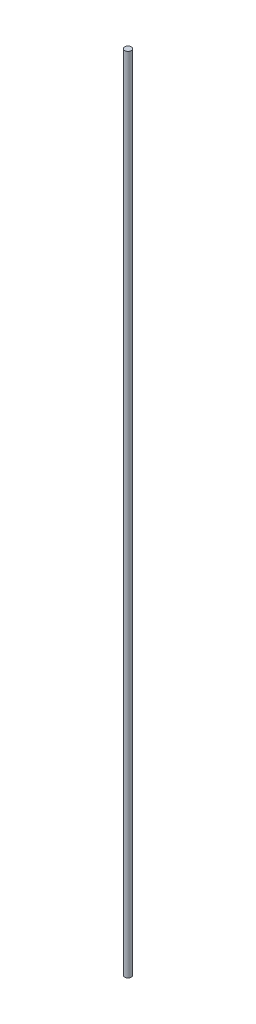
ISO-10303-21;
HEADER;
FILE_DESCRIPTION(('STEP AP214'),'2;1');
FILE_NAME('part.step','',(''),(''),'','','');
FILE_SCHEMA(('AUTOMOTIVE_DESIGN { 1 0 10303 214 1 1 1 1 }'));
ENDSEC;
DATA;
#1=APPLICATION_CONTEXT('core data for automotive mechanical design processes');
#2=APPLICATION_PROTOCOL_DEFINITION('international standard','automotive_design',2000,#1);
#3=PRODUCT_CONTEXT('',#1,'mechanical');
#4=PRODUCT('Part','Part','',(#3));
#5=PRODUCT_RELATED_PRODUCT_CATEGORY('part','',(#4));
#6=PRODUCT_DEFINITION_FORMATION('','',#4);
#7=PRODUCT_DEFINITION_CONTEXT('part definition',#1,'design');
#8=PRODUCT_DEFINITION('design','',#6,#7);
#9=PRODUCT_DEFINITION_SHAPE('','',#8);
#10=(LENGTH_UNIT() NAMED_UNIT(*) SI_UNIT(.MILLI.,.METRE.));
#11=(NAMED_UNIT(*) PLANE_ANGLE_UNIT() SI_UNIT($,.RADIAN.));
#12=(NAMED_UNIT(*) SI_UNIT($,.STERADIAN.) SOLID_ANGLE_UNIT());
#13=UNCERTAINTY_MEASURE_WITH_UNIT(LENGTH_MEASURE(1.E-05),#10,'distance_accuracy_value','');
#14=(GEOMETRIC_REPRESENTATION_CONTEXT(3) GLOBAL_UNCERTAINTY_ASSIGNED_CONTEXT((#13)) GLOBAL_UNIT_ASSIGNED_CONTEXT((#10,
#11,#12)) REPRESENTATION_CONTEXT('',''));
#15=CARTESIAN_POINT('',(0.,0.,0.));
#16=DIRECTION('',(0.,0.,1.));
#17=DIRECTION('',(1.,0.,0.));
#18=AXIS2_PLACEMENT_3D('',#15,#16,#17);
#19=CARTESIAN_POINT('',(0.,974.,0.));
#20=DIRECTION('',(0.,-1.,0.));
#21=DIRECTION('',(0.,0.,-1.));
#22=AXIS2_PLACEMENT_3D('',#19,#20,#21);
#23=CYLINDRICAL_SURFACE('',#22,4.);
#24=CARTESIAN_POINT('',(0.,974.,0.));
#25=DIRECTION('',(0.,1.,0.));
#26=DIRECTION('',(0.,0.,1.));
#27=AXIS2_PLACEMENT_3D('',#24,#25,#26);
#28=CIRCLE('',#27,4.);
#29=CARTESIAN_POINT('',(0.,974.,4.));
#30=VERTEX_POINT('',#29);
#31=EDGE_CURVE('E10',#30,#30,#28,.T.);
#32=ORIENTED_EDGE('',*,*,#31,.F.);
#33=EDGE_LOOP('',(#32));
#34=FACE_BOUND('',#33,.T.);
#35=CARTESIAN_POINT('',(0.,0.,0.));
#36=DIRECTION('',(0.,1.,0.));
#37=DIRECTION('',(0.,0.,1.));
#38=AXIS2_PLACEMENT_3D('',#35,#36,#37);
#39=CIRCLE('',#38,4.);
#40=CARTESIAN_POINT('',(0.,0.,4.));
#41=VERTEX_POINT('',#40);
#42=EDGE_CURVE('E40',#41,#41,#39,.T.);
#43=ORIENTED_EDGE('',*,*,#42,.T.);
#44=EDGE_LOOP('',(#43));
#45=FACE_BOUND('',#44,.T.);
#46=ADVANCED_FACE('F37',(#34,#45),#23,.T.);
#47=CARTESIAN_POINT('',(0.,974.,0.));
#48=DIRECTION('',(0.,1.,0.));
#49=DIRECTION('',(0.,0.,1.));
#50=AXIS2_PLACEMENT_3D('',#47,#48,#49);
#51=PLANE('',#50);
#52=ORIENTED_EDGE('',*,*,#31,.T.);
#53=EDGE_LOOP('',(#52));
#54=FACE_BOUND('',#53,.T.);
#55=ADVANCED_FACE('F54',(#54),#51,.T.);
#56=CARTESIAN_POINT('',(0.,0.,0.));
#57=DIRECTION('',(0.,1.,0.));
#58=DIRECTION('',(0.,0.,1.));
#59=AXIS2_PLACEMENT_3D('',#56,#57,#58);
#60=PLANE('',#59);
#61=ORIENTED_EDGE('',*,*,#42,.F.);
#62=EDGE_LOOP('',(#61));
#63=FACE_BOUND('',#62,.T.);
#64=ADVANCED_FACE('F52',(#63),#60,.F.);
#65=CLOSED_SHELL('',(#46,#55,#64));
#66=MANIFOLD_SOLID_BREP('B2',#65);
#67=ADVANCED_BREP_SHAPE_REPRESENTATION('',(#18,#66),#14);
#68=SHAPE_DEFINITION_REPRESENTATION(#9,#67);
ENDSEC;
END-ISO-10303-21;
